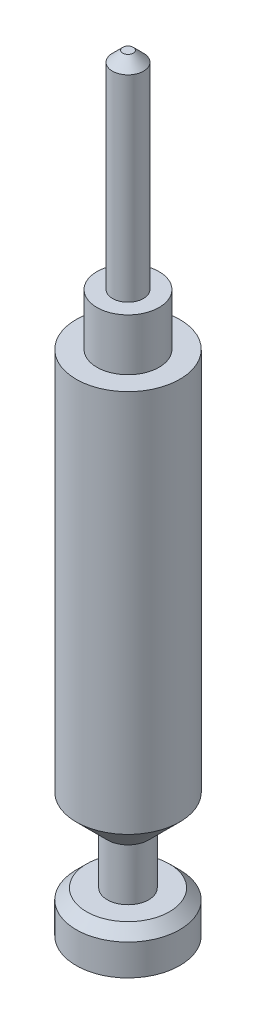
ISO-10303-21;
HEADER;
FILE_DESCRIPTION(('STEP AP214'),'2;1');
FILE_NAME('part.step','',(''),(''),'','','');
FILE_SCHEMA(('AUTOMOTIVE_DESIGN { 1 0 10303 214 1 1 1 1 }'));
ENDSEC;
DATA;
#1=APPLICATION_CONTEXT('core data for automotive mechanical design processes');
#2=APPLICATION_PROTOCOL_DEFINITION('international standard','automotive_design',2000,#1);
#3=PRODUCT_CONTEXT('',#1,'mechanical');
#4=PRODUCT('Part','Part','',(#3));
#5=PRODUCT_RELATED_PRODUCT_CATEGORY('part','',(#4));
#6=PRODUCT_DEFINITION_FORMATION('','',#4);
#7=PRODUCT_DEFINITION_CONTEXT('part definition',#1,'design');
#8=PRODUCT_DEFINITION('design','',#6,#7);
#9=PRODUCT_DEFINITION_SHAPE('','',#8);
#10=(LENGTH_UNIT() NAMED_UNIT(*) SI_UNIT(.MILLI.,.METRE.));
#11=(NAMED_UNIT(*) PLANE_ANGLE_UNIT() SI_UNIT($,.RADIAN.));
#12=(NAMED_UNIT(*) SI_UNIT($,.STERADIAN.) SOLID_ANGLE_UNIT());
#13=UNCERTAINTY_MEASURE_WITH_UNIT(LENGTH_MEASURE(1.E-05),#10,'distance_accuracy_value','');
#14=(GEOMETRIC_REPRESENTATION_CONTEXT(3) GLOBAL_UNCERTAINTY_ASSIGNED_CONTEXT((#13)) GLOBAL_UNIT_ASSIGNED_CONTEXT((#10,
#11,#12)) REPRESENTATION_CONTEXT('',''));
#15=CARTESIAN_POINT('',(0.,0.,0.));
#16=DIRECTION('',(0.,0.,1.));
#17=DIRECTION('',(1.,0.,0.));
#18=AXIS2_PLACEMENT_3D('',#15,#16,#17);
#19=CARTESIAN_POINT('',(0.,40.,0.));
#20=DIRECTION('',(0.,-1.,0.));
#21=DIRECTION('',(0.,0.,-1.));
#22=AXIS2_PLACEMENT_3D('',#19,#20,#21);
#23=CYLINDRICAL_SURFACE('',#22,5.);
#24=CARTESIAN_POINT('',(0.,3.,0.));
#25=DIRECTION('',(0.,1.,0.));
#26=DIRECTION('',(0.,0.,1.));
#27=AXIS2_PLACEMENT_3D('',#24,#25,#26);
#28=CIRCLE('',#27,5.);
#29=CARTESIAN_POINT('',(0.,3.,5.));
#30=VERTEX_POINT('',#29);
#31=EDGE_CURVE('E50',#30,#30,#28,.T.);
#32=ORIENTED_EDGE('',*,*,#31,.T.);
#33=EDGE_LOOP('',(#32));
#34=FACE_BOUND('',#33,.T.);
#35=CARTESIAN_POINT('',(0.,40.,0.));
#36=DIRECTION('',(0.,1.,0.));
#37=DIRECTION('',(0.,0.,1.));
#38=AXIS2_PLACEMENT_3D('',#35,#36,#37);
#39=CIRCLE('',#38,5.);
#40=CARTESIAN_POINT('',(0.,40.,5.));
#41=VERTEX_POINT('',#40);
#42=EDGE_CURVE('E64',#41,#41,#39,.T.);
#43=ORIENTED_EDGE('',*,*,#42,.F.);
#44=EDGE_LOOP('',(#43));
#45=FACE_BOUND('',#44,.T.);
#46=ADVANCED_FACE('F39',(#34,#45),#23,.T.);
#47=CARTESIAN_POINT('',(0.,40.,0.));
#48=DIRECTION('',(0.,1.,0.));
#49=DIRECTION('',(0.,0.,1.));
#50=AXIS2_PLACEMENT_3D('',#47,#48,#49);
#51=PLANE('',#50);
#52=CARTESIAN_POINT('',(0.,40.,0.));
#53=DIRECTION('',(0.,1.,0.));
#54=DIRECTION('',(0.,0.,1.));
#55=AXIS2_PLACEMENT_3D('',#52,#53,#54);
#56=CIRCLE('',#55,3.);
#57=CARTESIAN_POINT('',(0.,40.,3.));
#58=VERTEX_POINT('',#57);
#59=EDGE_CURVE('E67',#58,#58,#56,.T.);
#60=ORIENTED_EDGE('',*,*,#59,.F.);
#61=EDGE_LOOP('',(#60));
#62=FACE_BOUND('',#61,.T.);
#63=ORIENTED_EDGE('',*,*,#42,.T.);
#64=EDGE_LOOP('',(#63));
#65=FACE_BOUND('',#64,.T.);
#66=ADVANCED_FACE('F101',(#62,#65),#51,.T.);
#67=CARTESIAN_POINT('',(0.,45.,0.));
#68=DIRECTION('',(0.,-1.,0.));
#69=DIRECTION('',(0.,0.,-1.));
#70=AXIS2_PLACEMENT_3D('',#67,#68,#69);
#71=CYLINDRICAL_SURFACE('',#70,3.);
#72=CARTESIAN_POINT('',(0.,45.,0.));
#73=DIRECTION('',(0.,1.,0.));
#74=DIRECTION('',(0.,0.,1.));
#75=AXIS2_PLACEMENT_3D('',#72,#73,#74);
#76=CIRCLE('',#75,3.);
#77=CARTESIAN_POINT('',(0.,45.,3.));
#78=VERTEX_POINT('',#77);
#79=EDGE_CURVE('E68',#78,#78,#76,.T.);
#80=ORIENTED_EDGE('',*,*,#79,.F.);
#81=EDGE_LOOP('',(#80));
#82=FACE_BOUND('',#81,.T.);
#83=ORIENTED_EDGE('',*,*,#59,.T.);
#84=EDGE_LOOP('',(#83));
#85=FACE_BOUND('',#84,.T.);
#86=ADVANCED_FACE('F107',(#82,#85),#71,.T.);
#87=CARTESIAN_POINT('',(0.,45.,0.));
#88=DIRECTION('',(0.,1.,0.));
#89=DIRECTION('',(0.,0.,1.));
#90=AXIS2_PLACEMENT_3D('',#87,#88,#89);
#91=PLANE('',#90);
#92=CARTESIAN_POINT('',(0.,45.,0.));
#93=DIRECTION('',(0.,1.,0.));
#94=DIRECTION('',(0.,0.,1.));
#95=AXIS2_PLACEMENT_3D('',#92,#93,#94);
#96=CIRCLE('',#95,1.5);
#97=CARTESIAN_POINT('',(0.,45.,1.5));
#98=VERTEX_POINT('',#97);
#99=EDGE_CURVE('E63',#98,#98,#96,.T.);
#100=ORIENTED_EDGE('',*,*,#99,.F.);
#101=EDGE_LOOP('',(#100));
#102=FACE_BOUND('',#101,.T.);
#103=ORIENTED_EDGE('',*,*,#79,.T.);
#104=EDGE_LOOP('',(#103));
#105=FACE_BOUND('',#104,.T.);
#106=ADVANCED_FACE('F173',(#102,#105),#91,.T.);
#107=CARTESIAN_POINT('',(0.,65.,0.));
#108=DIRECTION('',(0.,-1.,0.));
#109=DIRECTION('',(0.,0.,-1.));
#110=AXIS2_PLACEMENT_3D('',#107,#108,#109);
#111=CYLINDRICAL_SURFACE('',#110,1.5);
#112=CARTESIAN_POINT('',(0.,64.,0.));
#113=DIRECTION('',(0.,1.,0.));
#114=DIRECTION('',(0.,0.,1.));
#115=AXIS2_PLACEMENT_3D('',#112,#113,#114);
#116=CIRCLE('',#115,1.5);
#117=CARTESIAN_POINT('',(0.,64.,-1.50000000000001));
#118=VERTEX_POINT('',#117);
#119=EDGE_CURVE('E57',#118,#118,#116,.F.);
#120=ORIENTED_EDGE('',*,*,#119,.T.);
#121=EDGE_LOOP('',(#120));
#122=FACE_BOUND('',#121,.T.);
#123=ORIENTED_EDGE('',*,*,#99,.T.);
#124=EDGE_LOOP('',(#123));
#125=FACE_BOUND('',#124,.T.);
#126=ADVANCED_FACE('F163',(#122,#125),#111,.T.);
#127=CARTESIAN_POINT('',(0.,65.,0.));
#128=DIRECTION('',(0.,1.,0.));
#129=DIRECTION('',(0.,0.,1.));
#130=AXIS2_PLACEMENT_3D('',#127,#128,#129);
#131=PLANE('',#130);
#132=CARTESIAN_POINT('',(0.,65.,0.));
#133=DIRECTION('',(0.,1.,0.));
#134=DIRECTION('',(0.,0.,1.));
#135=AXIS2_PLACEMENT_3D('',#132,#133,#134);
#136=CIRCLE('',#135,0.500000000000014);
#137=CARTESIAN_POINT('',(0.,65.,-0.500000000000021));
#138=VERTEX_POINT('',#137);
#139=EDGE_CURVE('E60',#138,#138,#136,.T.);
#140=ORIENTED_EDGE('',*,*,#139,.T.);
#141=EDGE_LOOP('',(#140));
#142=FACE_BOUND('',#141,.T.);
#143=ADVANCED_FACE('F114',(#142),#131,.T.);
#144=CARTESIAN_POINT('',(0.,65.,0.));
#145=DIRECTION('',(0.,-1.,0.));
#146=DIRECTION('',(0.,0.,-1.));
#147=AXIS2_PLACEMENT_3D('',#144,#145,#146);
#148=CONICAL_SURFACE('',#147,0.500000000000014,0.785398163397448);
#149=CARTESIAN_POINT('',(0.,64.,-1.50000000000001));
#150=CARTESIAN_POINT('',(0.,64.0104166666667,-1.48958333333334));
#151=CARTESIAN_POINT('',(0.,64.0208333333333,-1.47916666666668));
#152=CARTESIAN_POINT('',(0.,64.0416666666667,-1.45833333333334));
#153=CARTESIAN_POINT('',(0.,64.0520833333333,-1.44791666666667));
#154=CARTESIAN_POINT('',(0.,64.0729166666667,-1.42708333333334));
#155=CARTESIAN_POINT('',(0.,64.0833333333333,-1.41666666666668));
#156=CARTESIAN_POINT('',(0.,64.1041666666667,-1.39583333333334));
#157=CARTESIAN_POINT('',(0.,64.1145833333333,-1.38541666666667));
#158=CARTESIAN_POINT('',(0.,64.1354166666667,-1.36458333333334));
#159=CARTESIAN_POINT('',(0.,64.1458333333333,-1.35416666666668));
#160=CARTESIAN_POINT('',(0.,64.1666666666667,-1.33333333333334));
#161=CARTESIAN_POINT('',(0.,64.1770833333333,-1.32291666666668));
#162=CARTESIAN_POINT('',(0.,64.1979166666667,-1.30208333333334));
#163=CARTESIAN_POINT('',(0.,64.2083333333333,-1.29166666666668));
#164=CARTESIAN_POINT('',(0.,64.2291666666667,-1.27083333333334));
#165=CARTESIAN_POINT('',(0.,64.2395833333333,-1.26041666666668));
#166=CARTESIAN_POINT('',(0.,64.2604166666667,-1.23958333333334));
#167=CARTESIAN_POINT('',(0.,64.2708333333333,-1.22916666666668));
#168=CARTESIAN_POINT('',(0.,64.2916666666667,-1.20833333333334));
#169=CARTESIAN_POINT('',(0.,64.3020833333333,-1.19791666666668));
#170=CARTESIAN_POINT('',(0.,64.3229166666667,-1.17708333333335));
#171=CARTESIAN_POINT('',(0.,64.3333333333333,-1.16666666666668));
#172=CARTESIAN_POINT('',(0.,64.3541666666667,-1.14583333333335));
#173=CARTESIAN_POINT('',(0.,64.3645833333333,-1.13541666666668));
#174=CARTESIAN_POINT('',(0.,64.3854166666667,-1.11458333333335));
#175=CARTESIAN_POINT('',(0.,64.3958333333333,-1.10416666666668));
#176=CARTESIAN_POINT('',(0.,64.4166666666667,-1.08333333333335));
#177=CARTESIAN_POINT('',(0.,64.4270833333333,-1.07291666666668));
#178=CARTESIAN_POINT('',(0.,64.4479166666667,-1.05208333333335));
#179=CARTESIAN_POINT('',(0.,64.4583333333333,-1.04166666666668));
#180=CARTESIAN_POINT('',(0.,64.4791666666667,-1.02083333333335));
#181=CARTESIAN_POINT('',(0.,64.4895833333333,-1.01041666666668));
#182=CARTESIAN_POINT('',(0.,64.5104166666667,-0.989583333333348));
#183=CARTESIAN_POINT('',(0.,64.5208333333333,-0.979166666666682));
#184=CARTESIAN_POINT('',(0.,64.5416666666667,-0.958333333333348));
#185=CARTESIAN_POINT('',(0.,64.5520833333333,-0.94791666666668));
#186=CARTESIAN_POINT('',(0.,64.5729166666667,-0.927083333333348));
#187=CARTESIAN_POINT('',(0.,64.5833333333333,-0.916666666666683));
#188=CARTESIAN_POINT('',(0.,64.6041666666667,-0.89583333333335));
#189=CARTESIAN_POINT('',(0.,64.6145833333333,-0.885416666666683));
#190=CARTESIAN_POINT('',(0.,64.6354166666667,-0.864583333333349));
#191=CARTESIAN_POINT('',(0.,64.6458333333333,-0.854166666666683));
#192=CARTESIAN_POINT('',(0.,64.6666666666667,-0.83333333333335));
#193=CARTESIAN_POINT('',(0.,64.6770833333333,-0.822916666666682));
#194=CARTESIAN_POINT('',(0.,64.6979166666667,-0.802083333333349));
#195=CARTESIAN_POINT('',(0.,64.7083333333333,-0.791666666666685));
#196=CARTESIAN_POINT('',(0.,64.7291666666667,-0.770833333333352));
#197=CARTESIAN_POINT('',(0.,64.7395833333333,-0.760416666666685));
#198=CARTESIAN_POINT('',(0.,64.7604166666667,-0.739583333333351));
#199=CARTESIAN_POINT('',(0.,64.7708333333333,-0.729166666666685));
#200=CARTESIAN_POINT('',(0.,64.7916666666667,-0.708333333333352));
#201=CARTESIAN_POINT('',(0.,64.8020833333333,-0.697916666666686));
#202=CARTESIAN_POINT('',(0.,64.8229166666667,-0.677083333333352));
#203=CARTESIAN_POINT('',(0.,64.8333333333333,-0.666666666666684));
#204=CARTESIAN_POINT('',(0.,64.8541666666667,-0.645833333333352));
#205=CARTESIAN_POINT('',(0.,64.8645833333333,-0.635416666666687));
#206=CARTESIAN_POINT('',(0.,64.8854166666667,-0.614583333333354));
#207=CARTESIAN_POINT('',(0.,64.8958333333333,-0.604166666666687));
#208=CARTESIAN_POINT('',(0.,64.9166666666667,-0.583333333333353));
#209=CARTESIAN_POINT('',(0.,64.9270833333333,-0.572916666666687));
#210=CARTESIAN_POINT('',(0.,64.9479166666667,-0.552083333333354));
#211=CARTESIAN_POINT('',(0.,64.9583333333333,-0.541666666666687));
#212=CARTESIAN_POINT('',(0.,64.9791666666667,-0.520833333333353));
#213=CARTESIAN_POINT('',(0.,64.9895833333333,-0.510416666666686));
#214=CARTESIAN_POINT('',(0.,65.,-0.500000000000021));
#215=B_SPLINE_CURVE_WITH_KNOTS('',3,(#149,#150,#151,#152,#153,#154,#155,#156,#157,#158,#159,
#160,#161,#162,#163,#164,#165,#166,#167,#168,#169,#170,#171,#172,#173,#174,#175,#176,#177,#178,
#179,#180,#181,#182,#183,#184,#185,#186,#187,#188,#189,#190,#191,#192,#193,#194,#195,#196,#197,
#198,#199,#200,#201,#202,#203,#204,#205,#206,#207,#208,#209,#210,#211,#212,#213,#214),
.UNSPECIFIED.,.F.,.F.,(4,2,2,2,2,2,2,2,2,2,2,2,2,2,2,2,2,2,2,2,2,2,2,2,2,2,2,2,2,2,2,2,4),(0.,
0.0441941738241663,0.0883883476483228,0.132582521472479,0.176776695296636,0.220970869120802,
0.265165042944959,0.309359216769115,0.353553390593272,0.397747564417428,0.441941738241594,
0.486135912065751,0.530330085889907,0.574524259714064,0.61871843353823,0.662912607362386,
0.707106781186543,0.751300955010699,0.795495128834856,0.839689302659022,0.883883476483179,
0.928077650307335,0.972271824131492,1.01646599795566,1.06066017177981,1.10485434560397,
1.14904851942813,1.19324269325228,1.23743686707645,1.28163104090061,1.32582521472476,
1.37001938854892,1.41421356237309),.UNSPECIFIED.);
#216=EDGE_CURVE('BSEAM96',#118,#138,#215,.T.);
#217=ORIENTED_EDGE('',*,*,#119,.F.);
#218=ORIENTED_EDGE('',*,*,#139,.F.);
#219=ORIENTED_EDGE('',*,*,#216,.T.);
#220=ORIENTED_EDGE('',*,*,#216,.F.);
#221=EDGE_LOOP('',(#217,#219,#218,#220));
#222=FACE_BOUND('',#221,.T.);
#223=ADVANCED_FACE('F96',(#222),#148,.T.);
#224=CARTESIAN_POINT('',(0.,-5.,0.));
#225=DIRECTION('',(0.,1.,0.));
#226=DIRECTION('',(0.,0.,1.));
#227=AXIS2_PLACEMENT_3D('',#224,#225,#226);
#228=CYLINDRICAL_SURFACE('',#227,2.);
#229=CARTESIAN_POINT('',(0.,-5.,0.));
#230=DIRECTION('',(0.,-1.,0.));
#231=DIRECTION('',(0.,0.,-1.));
#232=AXIS2_PLACEMENT_3D('',#229,#230,#231);
#233=CIRCLE('',#232,2.);
#234=CARTESIAN_POINT('',(0.,-5.,-2.));
#235=VERTEX_POINT('',#234);
#236=EDGE_CURVE('E73',#235,#235,#233,.T.);
#237=ORIENTED_EDGE('',*,*,#236,.F.);
#238=EDGE_LOOP('',(#237));
#239=FACE_BOUND('',#238,.T.);
#240=CARTESIAN_POINT('',(0.,0.,0.));
#241=DIRECTION('',(0.,-1.,0.));
#242=DIRECTION('',(0.,0.,-1.));
#243=AXIS2_PLACEMENT_3D('',#240,#241,#242);
#244=CIRCLE('',#243,2.);
#245=CARTESIAN_POINT('',(0.,0.,-2.));
#246=VERTEX_POINT('',#245);
#247=EDGE_CURVE('E54',#246,#246,#244,.T.);
#248=ORIENTED_EDGE('',*,*,#247,.T.);
#249=EDGE_LOOP('',(#248));
#250=FACE_BOUND('',#249,.T.);
#251=ADVANCED_FACE('F88',(#239,#250),#228,.T.);
#252=CARTESIAN_POINT('',(0.,-9.,0.));
#253=DIRECTION('',(0.,1.,0.));
#254=DIRECTION('',(0.,0.,1.));
#255=AXIS2_PLACEMENT_3D('',#252,#253,#254);
#256=CYLINDRICAL_SURFACE('',#255,5.);
#257=CARTESIAN_POINT('',(0.,-5.99999999999999,0.));
#258=DIRECTION('',(0.,-1.,0.));
#259=DIRECTION('',(0.,0.,-1.));
#260=AXIS2_PLACEMENT_3D('',#257,#258,#259);
#261=CIRCLE('',#260,5.);
#262=CARTESIAN_POINT('',(0.,-5.99999999999999,-5.));
#263=VERTEX_POINT('',#262);
#264=EDGE_CURVE('E46',#263,#263,#261,.T.);
#265=ORIENTED_EDGE('',*,*,#264,.T.);
#266=EDGE_LOOP('',(#265));
#267=FACE_BOUND('',#266,.T.);
#268=CARTESIAN_POINT('',(0.,-9.,0.));
#269=DIRECTION('',(0.,-1.,0.));
#270=DIRECTION('',(0.,0.,-1.));
#271=AXIS2_PLACEMENT_3D('',#268,#269,#270);
#272=CIRCLE('',#271,5.);
#273=CARTESIAN_POINT('',(0.,-9.,-5.));
#274=VERTEX_POINT('',#273);
#275=EDGE_CURVE('E80',#274,#274,#272,.T.);
#276=ORIENTED_EDGE('',*,*,#275,.F.);
#277=EDGE_LOOP('',(#276));
#278=FACE_BOUND('',#277,.T.);
#279=ADVANCED_FACE('F86',(#267,#278),#256,.T.);
#280=CARTESIAN_POINT('',(0.,-9.,0.));
#281=DIRECTION('',(0.,-1.,0.));
#282=DIRECTION('',(0.,0.,-1.));
#283=AXIS2_PLACEMENT_3D('',#280,#281,#282);
#284=PLANE('',#283);
#285=ORIENTED_EDGE('',*,*,#275,.T.);
#286=EDGE_LOOP('',(#285));
#287=FACE_BOUND('',#286,.T.);
#288=ADVANCED_FACE('F84',(#287),#284,.T.);
#289=CARTESIAN_POINT('',(0.,-5.,0.));
#290=DIRECTION('',(0.,-1.,0.));
#291=DIRECTION('',(0.,0.,-1.));
#292=AXIS2_PLACEMENT_3D('',#289,#290,#291);
#293=PLANE('',#292);
#294=CARTESIAN_POINT('',(0.,-5.,0.));
#295=DIRECTION('',(0.,-1.,0.));
#296=DIRECTION('',(0.,0.,-1.));
#297=AXIS2_PLACEMENT_3D('',#294,#295,#296);
#298=CIRCLE('',#297,4.);
#299=CARTESIAN_POINT('',(0.,-5.,-4.));
#300=VERTEX_POINT('',#299);
#301=EDGE_CURVE('E10',#300,#300,#298,.F.);
#302=ORIENTED_EDGE('',*,*,#301,.T.);
#303=EDGE_LOOP('',(#302));
#304=FACE_BOUND('',#303,.T.);
#305=ORIENTED_EDGE('',*,*,#236,.T.);
#306=EDGE_LOOP('',(#305));
#307=FACE_BOUND('',#306,.T.);
#308=ADVANCED_FACE('F94',(#304,#307),#293,.F.);
#309=CARTESIAN_POINT('',(0.,3.,0.));
#310=DIRECTION('',(0.,1.,0.));
#311=DIRECTION('',(0.,0.,1.));
#312=AXIS2_PLACEMENT_3D('',#309,#310,#311);
#313=CONICAL_SURFACE('',#312,5.,0.785398163397449);
#314=ORIENTED_EDGE('',*,*,#247,.F.);
#315=EDGE_LOOP('',(#314));
#316=FACE_BOUND('',#315,.T.);
#317=ORIENTED_EDGE('',*,*,#31,.F.);
#318=EDGE_LOOP('',(#317));
#319=FACE_BOUND('',#318,.T.);
#320=ADVANCED_FACE('F116',(#316,#319),#313,.T.);
#321=CARTESIAN_POINT('',(0.,-5.99999999999999,0.));
#322=DIRECTION('',(0.,-1.,0.));
#323=DIRECTION('',(0.,0.,-1.));
#324=AXIS2_PLACEMENT_3D('',#321,#322,#323);
#325=CONICAL_SURFACE('',#324,5.,0.78539816339745);
#326=ORIENTED_EDGE('',*,*,#301,.F.);
#327=EDGE_LOOP('',(#326));
#328=FACE_BOUND('',#327,.T.);
#329=ORIENTED_EDGE('',*,*,#264,.F.);
#330=EDGE_LOOP('',(#329));
#331=FACE_BOUND('',#330,.T.);
#332=ADVANCED_FACE('F41',(#328,#331),#325,.T.);
#333=CLOSED_SHELL('',(#46,#66,#86,#106,#126,#143,#223,#251,#279,#288,#308,#320,#332));
#334=MANIFOLD_SOLID_BREP('B2',#333);
#335=ADVANCED_BREP_SHAPE_REPRESENTATION('',(#18,#334),#14);
#336=SHAPE_DEFINITION_REPRESENTATION(#9,#335);
ENDSEC;
END-ISO-10303-21;
